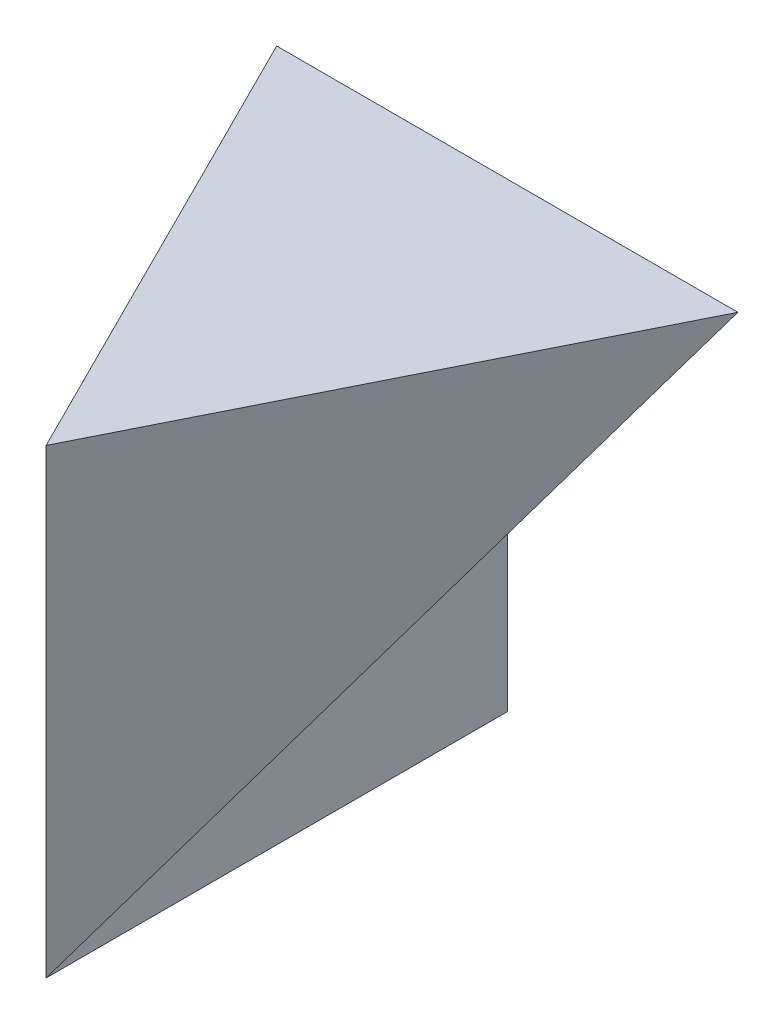
ISO-10303-21;
HEADER;
FILE_DESCRIPTION(('STEP AP214'),'2;1');
FILE_NAME('part.step','',(''),(''),'','','');
FILE_SCHEMA(('AUTOMOTIVE_DESIGN { 1 0 10303 214 1 1 1 1 }'));
ENDSEC;
DATA;
#1=APPLICATION_CONTEXT('core data for automotive mechanical design processes');
#2=APPLICATION_PROTOCOL_DEFINITION('international standard','automotive_design',2000,#1);
#3=PRODUCT_CONTEXT('',#1,'mechanical');
#4=PRODUCT('Part','Part','',(#3));
#5=PRODUCT_RELATED_PRODUCT_CATEGORY('part','',(#4));
#6=PRODUCT_DEFINITION_FORMATION('','',#4);
#7=PRODUCT_DEFINITION_CONTEXT('part definition',#1,'design');
#8=PRODUCT_DEFINITION('design','',#6,#7);
#9=PRODUCT_DEFINITION_SHAPE('','',#8);
#10=(LENGTH_UNIT() NAMED_UNIT(*) SI_UNIT(.MILLI.,.METRE.));
#11=(NAMED_UNIT(*) PLANE_ANGLE_UNIT() SI_UNIT($,.RADIAN.));
#12=(NAMED_UNIT(*) SI_UNIT($,.STERADIAN.) SOLID_ANGLE_UNIT());
#13=UNCERTAINTY_MEASURE_WITH_UNIT(LENGTH_MEASURE(1.E-05),#10,'distance_accuracy_value','');
#14=(GEOMETRIC_REPRESENTATION_CONTEXT(3) GLOBAL_UNCERTAINTY_ASSIGNED_CONTEXT((#13)) GLOBAL_UNIT_ASSIGNED_CONTEXT((#10,
#11,#12)) REPRESENTATION_CONTEXT('',''));
#15=CARTESIAN_POINT('',(0.,0.,0.));
#16=DIRECTION('',(0.,0.,1.));
#17=DIRECTION('',(1.,0.,0.));
#18=AXIS2_PLACEMENT_3D('',#15,#16,#17);
#19=CARTESIAN_POINT('',(20.,0.,0.));
#20=DIRECTION('',(0.,0.707106781186548,0.707106781186548));
#21=DIRECTION('',(0.,-0.707106781186548,0.707106781186548));
#22=AXIS2_PLACEMENT_3D('',#19,#20,#21);
#23=PLANE('',#22);
#24=DIRECTION('',(0.333333333333333,0.666666666666667,-0.666666666666667));
#25=VECTOR('',#24,1.);
#26=CARTESIAN_POINT('',(20.,0.,0.));
#27=LINE('',#26,#25);
#28=CARTESIAN_POINT('',(20.,0.,0.));
#29=VERTEX_POINT('',#28);
#30=CARTESIAN_POINT('',(40.,40.,-40.));
#31=VERTEX_POINT('',#30);
#32=EDGE_CURVE('E111',#29,#31,#27,.T.);
#33=ORIENTED_EDGE('',*,*,#32,.F.);
#34=DIRECTION('',(0.,-0.707106781186548,0.707106781186548));
#35=VECTOR('',#34,1.);
#36=CARTESIAN_POINT('',(20.,0.,0.));
#37=LINE('',#36,#35);
#38=CARTESIAN_POINT('',(20.,40.,-40.));
#39=VERTEX_POINT('',#38);
#40=EDGE_CURVE('E121',#39,#29,#37,.T.);
#41=ORIENTED_EDGE('',*,*,#40,.F.);
#42=DIRECTION('',(-1.,0.,0.));
#43=VECTOR('',#42,1.);
#44=CARTESIAN_POINT('',(40.,40.,-40.));
#45=LINE('',#44,#43);
#46=EDGE_CURVE('E79',#31,#39,#45,.T.);
#47=ORIENTED_EDGE('',*,*,#46,.F.);
#48=EDGE_LOOP('',(#33,#41,#47));
#49=FACE_BOUND('',#48,.T.);
#50=ADVANCED_FACE('F71',(#49),#23,.F.);
#51=CARTESIAN_POINT('',(40.,0.,-40.));
#52=DIRECTION('',(0.,0.,1.));
#53=DIRECTION('',(1.,0.,0.));
#54=AXIS2_PLACEMENT_3D('',#51,#52,#53);
#55=PLANE('',#54);
#56=DIRECTION('',(0.447213595499958,-0.894427190999916,0.));
#57=VECTOR('',#56,1.);
#58=CARTESIAN_POINT('',(24.,-8.,-40.));
#59=LINE('',#58,#57);
#60=CARTESIAN_POINT('',(0.,40.,-40.));
#61=VERTEX_POINT('',#60);
#62=CARTESIAN_POINT('',(20.,0.,-40.));
#63=VERTEX_POINT('',#62);
#64=EDGE_CURVE('E94',#61,#63,#59,.T.);
#65=ORIENTED_EDGE('',*,*,#64,.F.);
#66=EDGE_CURVE('E129',#39,#61,#45,.T.);
#67=ORIENTED_EDGE('',*,*,#66,.F.);
#68=DIRECTION('',(0.,1.,0.));
#69=VECTOR('',#68,1.);
#70=CARTESIAN_POINT('',(20.,40.,-40.));
#71=LINE('',#70,#69);
#72=EDGE_CURVE('E86',#63,#39,#71,.T.);
#73=ORIENTED_EDGE('',*,*,#72,.F.);
#74=EDGE_LOOP('',(#65,#67,#73));
#75=FACE_BOUND('',#74,.T.);
#76=ADVANCED_FACE('F73',(#75),#55,.F.);
#77=CARTESIAN_POINT('',(40.,40.,0.));
#78=DIRECTION('',(0.,-1.,0.));
#79=DIRECTION('',(0.,0.,-1.));
#80=AXIS2_PLACEMENT_3D('',#77,#78,#79);
#81=PLANE('',#80);
#82=DIRECTION('',(0.447213595499958,0.,0.894427190999916));
#83=VECTOR('',#82,1.);
#84=CARTESIAN_POINT('',(24.,40.,8.));
#85=LINE('',#84,#83);
#86=CARTESIAN_POINT('',(20.,40.,0.));
#87=VERTEX_POINT('',#86);
#88=EDGE_CURVE('E116',#61,#87,#85,.T.);
#89=ORIENTED_EDGE('',*,*,#88,.T.);
#90=DIRECTION('',(0.447213595499958,0.,-0.894427190999916));
#91=VECTOR('',#90,1.);
#92=CARTESIAN_POINT('',(24.,40.,-8.));
#93=LINE('',#92,#91);
#94=EDGE_CURVE('E113',#87,#31,#93,.T.);
#95=ORIENTED_EDGE('',*,*,#94,.T.);
#96=ORIENTED_EDGE('',*,*,#46,.T.);
#97=ORIENTED_EDGE('',*,*,#66,.T.);
#98=EDGE_LOOP('',(#89,#95,#96,#97));
#99=FACE_BOUND('',#98,.T.);
#100=ADVANCED_FACE('F134',(#99),#81,.F.);
#101=CARTESIAN_POINT('',(20.,0.,0.));
#102=DIRECTION('',(1.,0.,0.));
#103=DIRECTION('',(0.,0.,-1.));
#104=AXIS2_PLACEMENT_3D('',#101,#102,#103);
#105=PLANE('',#104);
#106=DIRECTION('',(0.,0.,-1.));
#107=VECTOR('',#106,1.);
#108=CARTESIAN_POINT('',(20.,0.,-40.));
#109=LINE('',#108,#107);
#110=EDGE_CURVE('E125',#29,#63,#109,.T.);
#111=ORIENTED_EDGE('',*,*,#110,.T.);
#112=ORIENTED_EDGE('',*,*,#72,.T.);
#113=ORIENTED_EDGE('',*,*,#40,.T.);
#114=EDGE_LOOP('',(#111,#112,#113));
#115=FACE_BOUND('',#114,.T.);
#116=ADVANCED_FACE('F128',(#115),#105,.T.);
#117=CARTESIAN_POINT('',(16.,8.,-60.));
#118=DIRECTION('',(-0.894427190999916,-0.447213595499958,0.));
#119=DIRECTION('',(0.447213595499958,-0.894427190999916,0.));
#120=AXIS2_PLACEMENT_3D('',#117,#118,#119);
#121=PLANE('',#120);
#122=DIRECTION('',(0.333333333333333,-0.666666666666667,0.666666666666667));
#123=VECTOR('',#122,1.);
#124=CARTESIAN_POINT('',(4.44444444444444,31.1111111111111,-31.1111111111111));
#125=LINE('',#124,#123);
#126=EDGE_CURVE('E12',#61,#29,#125,.T.);
#127=ORIENTED_EDGE('',*,*,#126,.F.);
#128=ORIENTED_EDGE('',*,*,#64,.T.);
#129=ORIENTED_EDGE('',*,*,#110,.F.);
#130=EDGE_LOOP('',(#127,#128,#129));
#131=FACE_BOUND('',#130,.T.);
#132=ADVANCED_FACE('F126',(#131),#121,.T.);
#133=CARTESIAN_POINT('',(16.,60.,-8.));
#134=DIRECTION('',(0.894427190999916,0.,-0.447213595499958));
#135=DIRECTION('',(-0.447213595499958,0.,-0.894427190999916));
#136=AXIS2_PLACEMENT_3D('',#133,#134,#135);
#137=PLANE('',#136);
#138=ORIENTED_EDGE('',*,*,#126,.T.);
#139=DIRECTION('',(0.,-1.,0.));
#140=VECTOR('',#139,1.);
#141=CARTESIAN_POINT('',(20.,60.,0.));
#142=LINE('',#141,#140);
#143=EDGE_CURVE('E108',#87,#29,#142,.T.);
#144=ORIENTED_EDGE('',*,*,#143,.F.);
#145=ORIENTED_EDGE('',*,*,#88,.F.);
#146=EDGE_LOOP('',(#138,#144,#145));
#147=FACE_BOUND('',#146,.T.);
#148=ADVANCED_FACE('F118',(#147),#137,.F.);
#149=CARTESIAN_POINT('',(16.,60.,8.));
#150=DIRECTION('',(-0.894427190999916,0.,-0.447213595499958));
#151=DIRECTION('',(-0.447213595499958,0.,0.894427190999916));
#152=AXIS2_PLACEMENT_3D('',#149,#150,#151);
#153=PLANE('',#152);
#154=ORIENTED_EDGE('',*,*,#143,.T.);
#155=ORIENTED_EDGE('',*,*,#32,.T.);
#156=ORIENTED_EDGE('',*,*,#94,.F.);
#157=EDGE_LOOP('',(#154,#155,#156));
#158=FACE_BOUND('',#157,.T.);
#159=ADVANCED_FACE('F109',(#158),#153,.F.);
#160=CLOSED_SHELL('',(#50,#76,#100,#116,#132,#148,#159));
#161=MANIFOLD_SOLID_BREP('B2',#160);
#162=ADVANCED_BREP_SHAPE_REPRESENTATION('',(#18,#161),#14);
#163=SHAPE_DEFINITION_REPRESENTATION(#9,#162);
ENDSEC;
END-ISO-10303-21;
